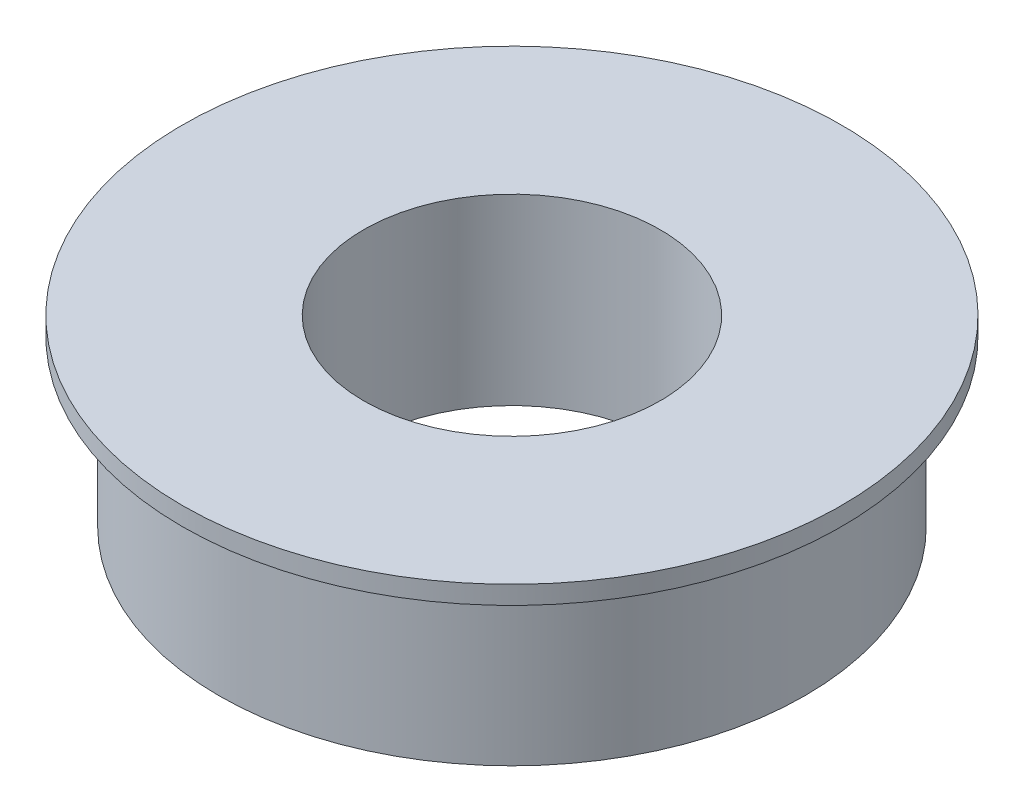
ISO-10303-21;
HEADER;
FILE_DESCRIPTION(('STEP AP214'),'2;1');
FILE_NAME('part.step','',(''),(''),'','','');
FILE_SCHEMA(('AUTOMOTIVE_DESIGN { 1 0 10303 214 1 1 1 1 }'));
ENDSEC;
DATA;
#1=APPLICATION_CONTEXT('core data for automotive mechanical design processes');
#2=APPLICATION_PROTOCOL_DEFINITION('international standard','automotive_design',2000,#1);
#3=PRODUCT_CONTEXT('',#1,'mechanical');
#4=PRODUCT('Part','Part','',(#3));
#5=PRODUCT_RELATED_PRODUCT_CATEGORY('part','',(#4));
#6=PRODUCT_DEFINITION_FORMATION('','',#4);
#7=PRODUCT_DEFINITION_CONTEXT('part definition',#1,'design');
#8=PRODUCT_DEFINITION('design','',#6,#7);
#9=PRODUCT_DEFINITION_SHAPE('','',#8);
#10=(LENGTH_UNIT() NAMED_UNIT(*) SI_UNIT(.MILLI.,.METRE.));
#11=(NAMED_UNIT(*) PLANE_ANGLE_UNIT() SI_UNIT($,.RADIAN.));
#12=(NAMED_UNIT(*) SI_UNIT($,.STERADIAN.) SOLID_ANGLE_UNIT());
#13=UNCERTAINTY_MEASURE_WITH_UNIT(LENGTH_MEASURE(1.E-05),#10,'distance_accuracy_value','');
#14=(GEOMETRIC_REPRESENTATION_CONTEXT(3) GLOBAL_UNCERTAINTY_ASSIGNED_CONTEXT((#13)) GLOBAL_UNIT_ASSIGNED_CONTEXT((#10,
#11,#12)) REPRESENTATION_CONTEXT('',''));
#15=CARTESIAN_POINT('',(0.,0.,0.));
#16=DIRECTION('',(0.,0.,1.));
#17=DIRECTION('',(1.,0.,0.));
#18=AXIS2_PLACEMENT_3D('',#15,#16,#17);
#19=CARTESIAN_POINT('',(0.,4.5,0.));
#20=DIRECTION('',(0.,-1.,0.));
#21=DIRECTION('',(0.,0.,-1.));
#22=AXIS2_PLACEMENT_3D('',#19,#20,#21);
#23=CYLINDRICAL_SURFACE('',#22,8.);
#24=CARTESIAN_POINT('',(0.,4.5,0.));
#25=DIRECTION('',(0.,1.,0.));
#26=DIRECTION('',(0.,0.,1.));
#27=AXIS2_PLACEMENT_3D('',#24,#25,#26);
#28=CIRCLE('',#27,8.);
#29=CARTESIAN_POINT('',(0.,4.5,8.));
#30=VERTEX_POINT('',#29);
#31=EDGE_CURVE('E10',#30,#30,#28,.T.);
#32=ORIENTED_EDGE('',*,*,#31,.F.);
#33=EDGE_LOOP('',(#32));
#34=FACE_BOUND('',#33,.T.);
#35=CARTESIAN_POINT('',(0.,0.,0.));
#36=DIRECTION('',(0.,1.,0.));
#37=DIRECTION('',(0.,0.,1.));
#38=AXIS2_PLACEMENT_3D('',#35,#36,#37);
#39=CIRCLE('',#38,8.);
#40=CARTESIAN_POINT('',(0.,0.,8.));
#41=VERTEX_POINT('',#40);
#42=EDGE_CURVE('E35',#41,#41,#39,.T.);
#43=ORIENTED_EDGE('',*,*,#42,.T.);
#44=EDGE_LOOP('',(#43));
#45=FACE_BOUND('',#44,.T.);
#46=ADVANCED_FACE('F32',(#34,#45),#23,.T.);
#47=CARTESIAN_POINT('',(0.,0.,0.));
#48=DIRECTION('',(0.,1.,0.));
#49=DIRECTION('',(0.,0.,1.));
#50=AXIS2_PLACEMENT_3D('',#47,#48,#49);
#51=PLANE('',#50);
#52=CARTESIAN_POINT('',(0.,0.,0.));
#53=DIRECTION('',(0.,1.,0.));
#54=DIRECTION('',(0.,0.,1.));
#55=AXIS2_PLACEMENT_3D('',#52,#53,#54);
#56=CIRCLE('',#55,4.05);
#57=CARTESIAN_POINT('',(0.,0.,4.05));
#58=VERTEX_POINT('',#57);
#59=EDGE_CURVE('E47',#58,#58,#56,.T.);
#60=ORIENTED_EDGE('',*,*,#59,.T.);
#61=EDGE_LOOP('',(#60));
#62=FACE_BOUND('',#61,.T.);
#63=ORIENTED_EDGE('',*,*,#42,.F.);
#64=EDGE_LOOP('',(#63));
#65=FACE_BOUND('',#64,.T.);
#66=ADVANCED_FACE('F56',(#62,#65),#51,.F.);
#67=CARTESIAN_POINT('',(0.,5.,0.));
#68=DIRECTION('',(0.,-1.,0.));
#69=DIRECTION('',(0.,0.,-1.));
#70=AXIS2_PLACEMENT_3D('',#67,#68,#69);
#71=CYLINDRICAL_SURFACE('',#70,9.);
#72=CARTESIAN_POINT('',(0.,5.,0.));
#73=DIRECTION('',(0.,1.,0.));
#74=DIRECTION('',(0.,0.,1.));
#75=AXIS2_PLACEMENT_3D('',#72,#73,#74);
#76=CIRCLE('',#75,9.);
#77=CARTESIAN_POINT('',(0.,5.,9.));
#78=VERTEX_POINT('',#77);
#79=EDGE_CURVE('E42',#78,#78,#76,.T.);
#80=ORIENTED_EDGE('',*,*,#79,.F.);
#81=EDGE_LOOP('',(#80));
#82=FACE_BOUND('',#81,.T.);
#83=CARTESIAN_POINT('',(0.,4.5,0.));
#84=DIRECTION('',(0.,1.,0.));
#85=DIRECTION('',(0.,0.,1.));
#86=AXIS2_PLACEMENT_3D('',#83,#84,#85);
#87=CIRCLE('',#86,9.);
#88=CARTESIAN_POINT('',(0.,4.5,9.));
#89=VERTEX_POINT('',#88);
#90=EDGE_CURVE('E44',#89,#89,#87,.T.);
#91=ORIENTED_EDGE('',*,*,#90,.T.);
#92=EDGE_LOOP('',(#91));
#93=FACE_BOUND('',#92,.T.);
#94=ADVANCED_FACE('F69',(#82,#93),#71,.T.);
#95=CARTESIAN_POINT('',(0.,5.,0.));
#96=DIRECTION('',(0.,1.,0.));
#97=DIRECTION('',(0.,0.,1.));
#98=AXIS2_PLACEMENT_3D('',#95,#96,#97);
#99=PLANE('',#98);
#100=CARTESIAN_POINT('',(0.,5.,0.));
#101=DIRECTION('',(0.,1.,0.));
#102=DIRECTION('',(0.,0.,1.));
#103=AXIS2_PLACEMENT_3D('',#100,#101,#102);
#104=CIRCLE('',#103,4.05);
#105=CARTESIAN_POINT('',(0.,5.,4.05));
#106=VERTEX_POINT('',#105);
#107=EDGE_CURVE('E50',#106,#106,#104,.T.);
#108=ORIENTED_EDGE('',*,*,#107,.F.);
#109=EDGE_LOOP('',(#108));
#110=FACE_BOUND('',#109,.T.);
#111=ORIENTED_EDGE('',*,*,#79,.T.);
#112=EDGE_LOOP('',(#111));
#113=FACE_BOUND('',#112,.T.);
#114=ADVANCED_FACE('F66',(#110,#113),#99,.T.);
#115=CARTESIAN_POINT('',(0.,4.5,0.));
#116=DIRECTION('',(0.,1.,0.));
#117=DIRECTION('',(0.,0.,1.));
#118=AXIS2_PLACEMENT_3D('',#115,#116,#117);
#119=PLANE('',#118);
#120=ORIENTED_EDGE('',*,*,#31,.T.);
#121=EDGE_LOOP('',(#120));
#122=FACE_BOUND('',#121,.T.);
#123=ORIENTED_EDGE('',*,*,#90,.F.);
#124=EDGE_LOOP('',(#123));
#125=FACE_BOUND('',#124,.T.);
#126=ADVANCED_FACE('F62',(#122,#125),#119,.F.);
#127=CARTESIAN_POINT('',(0.,0.,0.));
#128=DIRECTION('',(0.,1.,0.));
#129=DIRECTION('',(0.,0.,1.));
#130=AXIS2_PLACEMENT_3D('',#127,#128,#129);
#131=CYLINDRICAL_SURFACE('',#130,4.05);
#132=ORIENTED_EDGE('',*,*,#59,.F.);
#133=EDGE_LOOP('',(#132));
#134=FACE_BOUND('',#133,.T.);
#135=ORIENTED_EDGE('',*,*,#107,.T.);
#136=EDGE_LOOP('',(#135));
#137=FACE_BOUND('',#136,.T.);
#138=ADVANCED_FACE('F59',(#134,#137),#131,.F.);
#139=CLOSED_SHELL('',(#46,#66,#94,#114,#126,#138));
#140=MANIFOLD_SOLID_BREP('B2',#139);
#141=ADVANCED_BREP_SHAPE_REPRESENTATION('',(#18,#140),#14);
#142=SHAPE_DEFINITION_REPRESENTATION(#9,#141);
ENDSEC;
END-ISO-10303-21;
